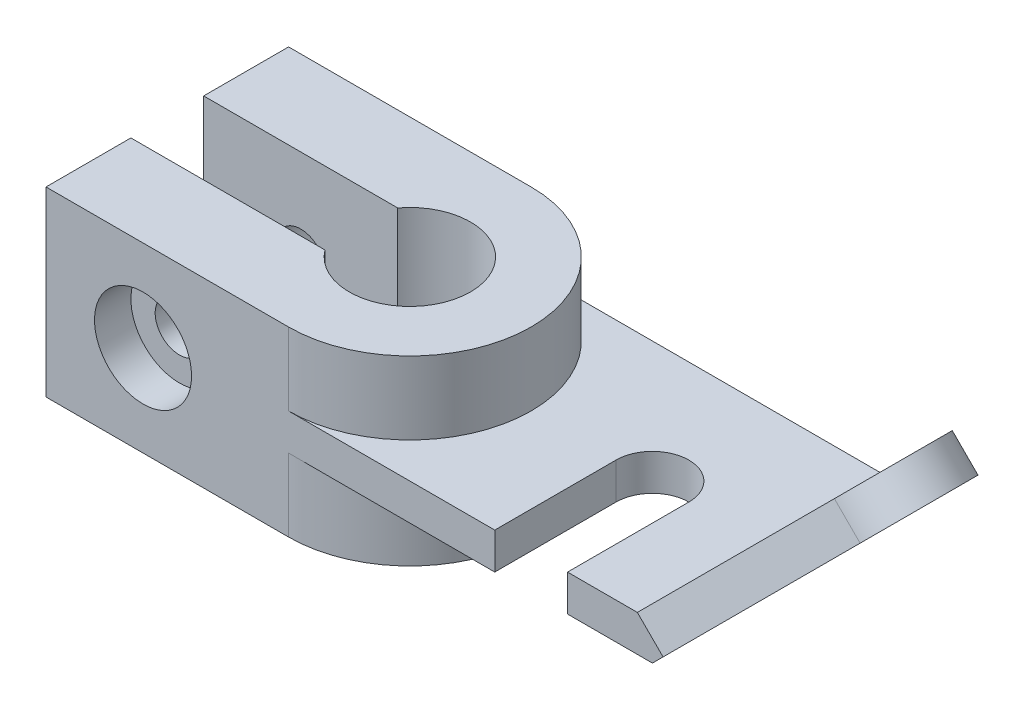
ISO-10303-21;
HEADER;
FILE_DESCRIPTION(('STEP AP214'),'2;1');
FILE_NAME('part.step','',(''),(''),'','','');
FILE_SCHEMA(('AUTOMOTIVE_DESIGN { 1 0 10303 214 1 1 1 1 }'));
ENDSEC;
DATA;
#1=APPLICATION_CONTEXT('core data for automotive mechanical design processes');
#2=APPLICATION_PROTOCOL_DEFINITION('international standard','automotive_design',2000,#1);
#3=PRODUCT_CONTEXT('',#1,'mechanical');
#4=PRODUCT('Part','Part','',(#3));
#5=PRODUCT_RELATED_PRODUCT_CATEGORY('part','',(#4));
#6=PRODUCT_DEFINITION_FORMATION('','',#4);
#7=PRODUCT_DEFINITION_CONTEXT('part definition',#1,'design');
#8=PRODUCT_DEFINITION('design','',#6,#7);
#9=PRODUCT_DEFINITION_SHAPE('','',#8);
#10=(LENGTH_UNIT() NAMED_UNIT(*) SI_UNIT(.MILLI.,.METRE.));
#11=(NAMED_UNIT(*) PLANE_ANGLE_UNIT() SI_UNIT($,.RADIAN.));
#12=(NAMED_UNIT(*) SI_UNIT($,.STERADIAN.) SOLID_ANGLE_UNIT());
#13=UNCERTAINTY_MEASURE_WITH_UNIT(LENGTH_MEASURE(1.E-05),#10,'distance_accuracy_value','');
#14=(GEOMETRIC_REPRESENTATION_CONTEXT(3) GLOBAL_UNCERTAINTY_ASSIGNED_CONTEXT((#13)) GLOBAL_UNIT_ASSIGNED_CONTEXT((#10,
#11,#12)) REPRESENTATION_CONTEXT('',''));
#15=CARTESIAN_POINT('',(0.,0.,0.));
#16=DIRECTION('',(0.,0.,1.));
#17=DIRECTION('',(1.,0.,0.));
#18=AXIS2_PLACEMENT_3D('',#15,#16,#17);
#19=CARTESIAN_POINT('',(-36.,22.5,-30.));
#20=DIRECTION('',(0.,0.,1.));
#21=DIRECTION('',(1.,0.,0.));
#22=AXIS2_PLACEMENT_3D('',#19,#20,#21);
#23=CYLINDRICAL_SURFACE('',#22,6.);
#24=CARTESIAN_POINT('',(-36.,22.5,-9.));
#25=DIRECTION('',(0.,0.,-1.));
#26=DIRECTION('',(-1.,0.,0.));
#27=AXIS2_PLACEMENT_3D('',#24,#25,#26);
#28=CIRCLE('',#27,6.);
#29=CARTESIAN_POINT('',(-42.,22.5,-9.));
#30=VERTEX_POINT('',#29);
#31=EDGE_CURVE('E251',#30,#30,#28,.T.);
#32=ORIENTED_EDGE('',*,*,#31,.F.);
#33=EDGE_LOOP('',(#32));
#34=FACE_BOUND('',#33,.T.);
#35=CARTESIAN_POINT('',(-36.,22.5,-21.));
#36=DIRECTION('',(0.,0.,-1.));
#37=DIRECTION('',(-1.,0.,0.));
#38=AXIS2_PLACEMENT_3D('',#35,#36,#37);
#39=CIRCLE('',#38,6.);
#40=CARTESIAN_POINT('',(-42.,22.5,-21.));
#41=VERTEX_POINT('',#40);
#42=EDGE_CURVE('E234',#41,#41,#39,.F.);
#43=ORIENTED_EDGE('',*,*,#42,.F.);
#44=EDGE_LOOP('',(#43));
#45=FACE_BOUND('',#44,.T.);
#46=ADVANCED_FACE('F45',(#34,#45),#23,.F.);
#47=CARTESIAN_POINT('',(-36.,22.5,8.99999999999999));
#48=DIRECTION('',(0.,0.,1.));
#49=DIRECTION('',(1.,0.,0.));
#50=AXIS2_PLACEMENT_3D('',#47,#48,#49);
#51=CIRCLE('',#50,6.);
#52=CARTESIAN_POINT('',(-30.,22.5,8.99999999999999));
#53=VERTEX_POINT('',#52);
#54=EDGE_CURVE('E247',#53,#53,#51,.T.);
#55=ORIENTED_EDGE('',*,*,#54,.F.);
#56=EDGE_LOOP('',(#55));
#57=FACE_BOUND('',#56,.T.);
#58=CARTESIAN_POINT('',(-36.,22.5,21.));
#59=DIRECTION('',(0.,0.,1.));
#60=DIRECTION('',(1.,0.,0.));
#61=AXIS2_PLACEMENT_3D('',#58,#59,#60);
#62=CIRCLE('',#61,6.);
#63=CARTESIAN_POINT('',(-30.,22.5,21.));
#64=VERTEX_POINT('',#63);
#65=EDGE_CURVE('E242',#64,#64,#62,.F.);
#66=ORIENTED_EDGE('',*,*,#65,.F.);
#67=EDGE_LOOP('',(#66));
#68=FACE_BOUND('',#67,.T.);
#69=ADVANCED_FACE('F489',(#57,#68),#23,.F.);
#70=CARTESIAN_POINT('',(0.,45.,0.));
#71=DIRECTION('',(0.,-1.,0.));
#72=DIRECTION('',(0.,0.,-1.));
#73=AXIS2_PLACEMENT_3D('',#70,#71,#72);
#74=CYLINDRICAL_SURFACE('',#73,30.);
#75=CARTESIAN_POINT('',(0.,18.,0.));
#76=DIRECTION('',(0.,-1.,0.));
#77=DIRECTION('',(0.,0.,-1.));
#78=AXIS2_PLACEMENT_3D('',#75,#76,#77);
#79=CIRCLE('',#78,30.);
#80=CARTESIAN_POINT('',(0.,18.,30.));
#81=VERTEX_POINT('',#80);
#82=CARTESIAN_POINT('',(0.,18.,-30.));
#83=VERTEX_POINT('',#82);
#84=EDGE_CURVE('E401',#81,#83,#79,.F.);
#85=ORIENTED_EDGE('',*,*,#84,.F.);
#86=DIRECTION('',(0.,-1.,0.));
#87=VECTOR('',#86,1.);
#88=CARTESIAN_POINT('',(0.,18.,30.));
#89=LINE('',#88,#87);
#90=CARTESIAN_POINT('',(0.,0.,30.));
#91=VERTEX_POINT('',#90);
#92=EDGE_CURVE('E289',#81,#91,#89,.T.);
#93=ORIENTED_EDGE('',*,*,#92,.T.);
#94=CARTESIAN_POINT('',(0.,0.,0.));
#95=DIRECTION('',(0.,1.,0.));
#96=DIRECTION('',(0.,0.,1.));
#97=AXIS2_PLACEMENT_3D('',#94,#95,#96);
#98=CIRCLE('',#97,30.);
#99=CARTESIAN_POINT('',(0.,0.,-30.));
#100=VERTEX_POINT('',#99);
#101=EDGE_CURVE('E255',#91,#100,#98,.T.);
#102=ORIENTED_EDGE('',*,*,#101,.T.);
#103=DIRECTION('',(0.,-1.,0.));
#104=VECTOR('',#103,1.);
#105=CARTESIAN_POINT('',(0.,18.,-30.));
#106=LINE('',#105,#104);
#107=EDGE_CURVE('E290',#83,#100,#106,.T.);
#108=ORIENTED_EDGE('',*,*,#107,.F.);
#109=EDGE_LOOP('',(#85,#93,#102,#108));
#110=FACE_BOUND('',#109,.T.);
#111=ADVANCED_FACE('F442',(#110),#74,.T.);
#112=CARTESIAN_POINT('',(0.,27.,0.));
#113=DIRECTION('',(0.,1.,0.));
#114=DIRECTION('',(0.,0.,1.));
#115=AXIS2_PLACEMENT_3D('',#112,#113,#114);
#116=PLANE('',#115);
#117=DIRECTION('',(0.,0.,1.));
#118=VECTOR('',#117,1.);
#119=CARTESIAN_POINT('',(86.2720779386422,27.,0.));
#120=LINE('',#119,#118);
#121=CARTESIAN_POINT('',(86.2720779386421,27.,-30.));
#122=VERTEX_POINT('',#121);
#123=CARTESIAN_POINT('',(86.2720779386422,27.,30.));
#124=VERTEX_POINT('',#123);
#125=EDGE_CURVE('E202',#122,#124,#120,.T.);
#126=ORIENTED_EDGE('',*,*,#125,.F.);
#127=DIRECTION('',(-1.,0.,0.));
#128=VECTOR('',#127,1.);
#129=CARTESIAN_POINT('',(90.,27.,-30.));
#130=LINE('',#129,#128);
#131=CARTESIAN_POINT('',(0.,27.,-30.));
#132=VERTEX_POINT('',#131);
#133=EDGE_CURVE('E302',#122,#132,#130,.T.);
#134=ORIENTED_EDGE('',*,*,#133,.T.);
#135=CARTESIAN_POINT('',(0.,27.,0.));
#136=DIRECTION('',(0.,1.,0.));
#137=DIRECTION('',(0.,0.,1.));
#138=AXIS2_PLACEMENT_3D('',#135,#136,#137);
#139=CIRCLE('',#138,30.);
#140=CARTESIAN_POINT('',(0.,27.,30.));
#141=VERTEX_POINT('',#140);
#142=EDGE_CURVE('E260',#132,#141,#139,.F.);
#143=ORIENTED_EDGE('',*,*,#142,.T.);
#144=DIRECTION('',(1.,0.,0.));
#145=VECTOR('',#144,1.);
#146=CARTESIAN_POINT('',(0.,27.,30.));
#147=LINE('',#146,#145);
#148=CARTESIAN_POINT('',(51.,27.,30.));
#149=VERTEX_POINT('',#148);
#150=EDGE_CURVE('E305',#141,#149,#147,.T.);
#151=ORIENTED_EDGE('',*,*,#150,.T.);
#152=DIRECTION('',(0.,0.,-1.));
#153=VECTOR('',#152,1.);
#154=CARTESIAN_POINT('',(51.,27.,30.));
#155=LINE('',#154,#153);
#156=CARTESIAN_POINT('',(51.,27.,0.));
#157=VERTEX_POINT('',#156);
#158=EDGE_CURVE('E309',#149,#157,#155,.T.);
#159=ORIENTED_EDGE('',*,*,#158,.T.);
#160=CARTESIAN_POINT('',(60.,27.,0.));
#161=DIRECTION('',(0.,-1.,0.));
#162=DIRECTION('',(0.,0.,1.));
#163=AXIS2_PLACEMENT_3D('',#160,#161,#162);
#164=CIRCLE('',#163,8.99999999999999);
#165=CARTESIAN_POINT('',(69.,27.,0.));
#166=VERTEX_POINT('',#165);
#167=EDGE_CURVE('E313',#157,#166,#164,.T.);
#168=ORIENTED_EDGE('',*,*,#167,.T.);
#169=DIRECTION('',(0.,0.,1.));
#170=VECTOR('',#169,1.);
#171=CARTESIAN_POINT('',(69.,27.,0.));
#172=LINE('',#171,#170);
#173=CARTESIAN_POINT('',(69.,27.,30.));
#174=VERTEX_POINT('',#173);
#175=EDGE_CURVE('E293',#166,#174,#172,.T.);
#176=ORIENTED_EDGE('',*,*,#175,.T.);
#177=DIRECTION('',(1.,0.,0.));
#178=VECTOR('',#177,1.);
#179=CARTESIAN_POINT('',(69.,27.,30.));
#180=LINE('',#179,#178);
#181=EDGE_CURVE('E299',#174,#124,#180,.T.);
#182=ORIENTED_EDGE('',*,*,#181,.T.);
#183=EDGE_LOOP('',(#126,#134,#143,#151,#159,#168,#176,#182));
#184=FACE_BOUND('',#183,.T.);
#185=ADVANCED_FACE('F427',(#184),#116,.T.);
#186=CARTESIAN_POINT('',(60.,18.,0.));
#187=DIRECTION('',(0.,-1.,0.));
#188=DIRECTION('',(0.,0.,-1.));
#189=AXIS2_PLACEMENT_3D('',#186,#187,#188);
#190=PLANE('',#189);
#191=DIRECTION('',(-1.,0.,0.));
#192=VECTOR('',#191,1.);
#193=CARTESIAN_POINT('',(0.,18.,30.));
#194=LINE('',#193,#192);
#195=CARTESIAN_POINT('',(51.,18.,30.));
#196=VERTEX_POINT('',#195);
#197=EDGE_CURVE('E266',#196,#81,#194,.T.);
#198=ORIENTED_EDGE('',*,*,#197,.T.);
#199=ORIENTED_EDGE('',*,*,#84,.T.);
#200=DIRECTION('',(1.,0.,0.));
#201=VECTOR('',#200,1.);
#202=CARTESIAN_POINT('',(0.,18.,-30.));
#203=LINE('',#202,#201);
#204=CARTESIAN_POINT('',(90.,18.,-30.));
#205=VERTEX_POINT('',#204);
#206=EDGE_CURVE('E269',#83,#205,#203,.T.);
#207=ORIENTED_EDGE('',*,*,#206,.T.);
#208=DIRECTION('',(0.,0.,1.));
#209=VECTOR('',#208,1.);
#210=CARTESIAN_POINT('',(90.,18.,30.));
#211=LINE('',#210,#209);
#212=CARTESIAN_POINT('',(90.,18.,30.));
#213=VERTEX_POINT('',#212);
#214=EDGE_CURVE('E273',#205,#213,#211,.T.);
#215=ORIENTED_EDGE('',*,*,#214,.T.);
#216=DIRECTION('',(-1.,0.,0.));
#217=VECTOR('',#216,1.);
#218=CARTESIAN_POINT('',(69.,18.,30.));
#219=LINE('',#218,#217);
#220=CARTESIAN_POINT('',(69.,18.,30.));
#221=VERTEX_POINT('',#220);
#222=EDGE_CURVE('E277',#213,#221,#219,.T.);
#223=ORIENTED_EDGE('',*,*,#222,.T.);
#224=DIRECTION('',(0.,0.,-1.));
#225=VECTOR('',#224,1.);
#226=CARTESIAN_POINT('',(69.,18.,0.));
#227=LINE('',#226,#225);
#228=CARTESIAN_POINT('',(69.,18.,0.));
#229=VERTEX_POINT('',#228);
#230=EDGE_CURVE('E280',#221,#229,#227,.T.);
#231=ORIENTED_EDGE('',*,*,#230,.T.);
#232=CARTESIAN_POINT('',(60.,18.,0.));
#233=DIRECTION('',(0.,1.,0.));
#234=DIRECTION('',(0.,0.,-1.));
#235=AXIS2_PLACEMENT_3D('',#232,#233,#234);
#236=CIRCLE('',#235,8.99999999999999);
#237=CARTESIAN_POINT('',(51.,18.,0.));
#238=VERTEX_POINT('',#237);
#239=EDGE_CURVE('E283',#229,#238,#236,.T.);
#240=ORIENTED_EDGE('',*,*,#239,.T.);
#241=DIRECTION('',(0.,0.,1.));
#242=VECTOR('',#241,1.);
#243=CARTESIAN_POINT('',(51.,18.,30.));
#244=LINE('',#243,#242);
#245=EDGE_CURVE('E286',#238,#196,#244,.T.);
#246=ORIENTED_EDGE('',*,*,#245,.T.);
#247=EDGE_LOOP('',(#198,#199,#207,#215,#223,#231,#240,#246));
#248=FACE_BOUND('',#247,.T.);
#249=ADVANCED_FACE('F436',(#248),#190,.T.);
#250=CARTESIAN_POINT('',(90.,0.,30.));
#251=DIRECTION('',(0.,0.,1.));
#252=DIRECTION('',(1.,0.,0.));
#253=AXIS2_PLACEMENT_3D('',#250,#251,#252);
#254=PLANE('',#253);
#255=DIRECTION('',(-0.707106781186544,0.707106781186551,0.));
#256=VECTOR('',#255,1.);
#257=CARTESIAN_POINT('',(123.026019100214,-9.75394116157223,30.));
#258=LINE('',#257,#256);
#259=CARTESIAN_POINT('',(92.6360389693211,20.636038969321,30.));
#260=VERTEX_POINT('',#259);
#261=EDGE_CURVE('E197',#260,#124,#258,.T.);
#262=ORIENTED_EDGE('',*,*,#261,.T.);
#263=ORIENTED_EDGE('',*,*,#181,.F.);
#264=DIRECTION('',(0.,1.,0.));
#265=VECTOR('',#264,1.);
#266=CARTESIAN_POINT('',(69.,0.,30.));
#267=LINE('',#266,#265);
#268=EDGE_CURVE('E325',#221,#174,#267,.T.);
#269=ORIENTED_EDGE('',*,*,#268,.F.);
#270=ORIENTED_EDGE('',*,*,#222,.F.);
#271=DIRECTION('',(0.707106781186551,0.707106781186544,0.));
#272=VECTOR('',#271,1.);
#273=CARTESIAN_POINT('',(90.,18.,30.));
#274=LINE('',#273,#272);
#275=EDGE_CURVE('E217',#213,#260,#274,.T.);
#276=ORIENTED_EDGE('',*,*,#275,.T.);
#277=EDGE_LOOP('',(#262,#263,#269,#270,#276));
#278=FACE_BOUND('',#277,.T.);
#279=ADVANCED_FACE('F433',(#278),#254,.T.);
#280=CARTESIAN_POINT('',(69.,0.,0.));
#281=DIRECTION('',(-1.,0.,0.));
#282=DIRECTION('',(0.,0.,1.));
#283=AXIS2_PLACEMENT_3D('',#280,#281,#282);
#284=PLANE('',#283);
#285=DIRECTION('',(0.,1.,0.));
#286=VECTOR('',#285,1.);
#287=CARTESIAN_POINT('',(69.,0.,0.));
#288=LINE('',#287,#286);
#289=EDGE_CURVE('E329',#229,#166,#288,.T.);
#290=ORIENTED_EDGE('',*,*,#289,.F.);
#291=ORIENTED_EDGE('',*,*,#230,.F.);
#292=ORIENTED_EDGE('',*,*,#268,.T.);
#293=ORIENTED_EDGE('',*,*,#175,.F.);
#294=EDGE_LOOP('',(#290,#291,#292,#293));
#295=FACE_BOUND('',#294,.T.);
#296=ADVANCED_FACE('F478',(#295),#284,.T.);
#297=CARTESIAN_POINT('',(60.,0.,0.));
#298=DIRECTION('',(0.,1.,0.));
#299=DIRECTION('',(0.,0.,1.));
#300=AXIS2_PLACEMENT_3D('',#297,#298,#299);
#301=CYLINDRICAL_SURFACE('',#300,8.99999999999999);
#302=DIRECTION('',(0.,1.,0.));
#303=VECTOR('',#302,1.);
#304=CARTESIAN_POINT('',(51.,0.,0.));
#305=LINE('',#304,#303);
#306=EDGE_CURVE('E332',#238,#157,#305,.T.);
#307=ORIENTED_EDGE('',*,*,#306,.F.);
#308=ORIENTED_EDGE('',*,*,#239,.F.);
#309=ORIENTED_EDGE('',*,*,#289,.T.);
#310=ORIENTED_EDGE('',*,*,#167,.F.);
#311=EDGE_LOOP('',(#307,#308,#309,#310));
#312=FACE_BOUND('',#311,.T.);
#313=ADVANCED_FACE('F475',(#312),#301,.F.);
#314=CARTESIAN_POINT('',(51.,0.,0.));
#315=DIRECTION('',(1.,0.,0.));
#316=DIRECTION('',(0.,0.,-1.));
#317=AXIS2_PLACEMENT_3D('',#314,#315,#316);
#318=PLANE('',#317);
#319=DIRECTION('',(0.,1.,0.));
#320=VECTOR('',#319,1.);
#321=CARTESIAN_POINT('',(51.,0.,30.));
#322=LINE('',#321,#320);
#323=EDGE_CURVE('E321',#196,#149,#322,.T.);
#324=ORIENTED_EDGE('',*,*,#323,.F.);
#325=ORIENTED_EDGE('',*,*,#245,.F.);
#326=ORIENTED_EDGE('',*,*,#306,.T.);
#327=ORIENTED_EDGE('',*,*,#158,.F.);
#328=EDGE_LOOP('',(#324,#325,#326,#327));
#329=FACE_BOUND('',#328,.T.);
#330=ADVANCED_FACE('F470',(#329),#318,.T.);
#331=CARTESIAN_POINT('',(-60.,45.,-30.));
#332=DIRECTION('',(0.,0.,1.));
#333=DIRECTION('',(1.,0.,0.));
#334=AXIS2_PLACEMENT_3D('',#331,#332,#333);
#335=PLANE('',#334);
#336=ORIENTED_EDGE('',*,*,#133,.F.);
#337=DIRECTION('',(-0.707106781186544,0.707106781186551,0.));
#338=VECTOR('',#337,1.);
#339=CARTESIAN_POINT('',(123.026019100214,-9.75394116157225,-30.));
#340=LINE('',#339,#338);
#341=CARTESIAN_POINT('',(92.636038969321,20.636038969321,-30.));
#342=VERTEX_POINT('',#341);
#343=EDGE_CURVE('E188',#342,#122,#340,.T.);
#344=ORIENTED_EDGE('',*,*,#343,.F.);
#345=DIRECTION('',(0.707106781186551,0.707106781186544,0.));
#346=VECTOR('',#345,1.);
#347=CARTESIAN_POINT('',(90.,18.,-30.));
#348=LINE('',#347,#346);
#349=EDGE_CURVE('E220',#205,#342,#348,.T.);
#350=ORIENTED_EDGE('',*,*,#349,.F.);
#351=ORIENTED_EDGE('',*,*,#206,.F.);
#352=ORIENTED_EDGE('',*,*,#107,.T.);
#353=DIRECTION('',(-1.,0.,0.));
#354=VECTOR('',#353,1.);
#355=CARTESIAN_POINT('',(-60.,0.,-30.));
#356=LINE('',#355,#354);
#357=CARTESIAN_POINT('',(-60.,0.,-30.));
#358=VERTEX_POINT('',#357);
#359=EDGE_CURVE('E328',#100,#358,#356,.T.);
#360=ORIENTED_EDGE('',*,*,#359,.T.);
#361=DIRECTION('',(0.,-1.,0.));
#362=VECTOR('',#361,1.);
#363=CARTESIAN_POINT('',(-60.,45.,-30.));
#364=LINE('',#363,#362);
#365=CARTESIAN_POINT('',(-60.,45.,-30.));
#366=VERTEX_POINT('',#365);
#367=EDGE_CURVE('E397',#366,#358,#364,.T.);
#368=ORIENTED_EDGE('',*,*,#367,.F.);
#369=DIRECTION('',(-1.,0.,0.));
#370=VECTOR('',#369,1.);
#371=CARTESIAN_POINT('',(-60.,45.,-30.));
#372=LINE('',#371,#370);
#373=CARTESIAN_POINT('',(0.,45.,-30.));
#374=VERTEX_POINT('',#373);
#375=EDGE_CURVE('E337',#374,#366,#372,.T.);
#376=ORIENTED_EDGE('',*,*,#375,.F.);
#377=DIRECTION('',(0.,1.,0.));
#378=VECTOR('',#377,1.);
#379=CARTESIAN_POINT('',(0.,27.,-30.));
#380=LINE('',#379,#378);
#381=EDGE_CURVE('E317',#132,#374,#380,.T.);
#382=ORIENTED_EDGE('',*,*,#381,.F.);
#383=EDGE_LOOP('',(#336,#344,#350,#351,#352,#360,#368,#376,#382));
#384=FACE_BOUND('',#383,.T.);
#385=CARTESIAN_POINT('',(-36.,22.5,-30.));
#386=DIRECTION('',(0.,0.,-1.));
#387=DIRECTION('',(-1.,0.,0.));
#388=AXIS2_PLACEMENT_3D('',#385,#386,#387);
#389=CIRCLE('',#388,12.);
#390=CARTESIAN_POINT('',(-48.,22.5,-30.));
#391=VERTEX_POINT('',#390);
#392=EDGE_CURVE('E229',#391,#391,#389,.T.);
#393=ORIENTED_EDGE('',*,*,#392,.F.);
#394=EDGE_LOOP('',(#393));
#395=FACE_BOUND('',#394,.T.);
#396=ADVANCED_FACE('F47',(#384,#395),#335,.F.);
#397=CARTESIAN_POINT('',(-60.,45.,-30.));
#398=DIRECTION('',(1.,0.,0.));
#399=DIRECTION('',(0.,0.,-1.));
#400=AXIS2_PLACEMENT_3D('',#397,#398,#399);
#401=PLANE('',#400);
#402=DIRECTION('',(0.,0.,1.));
#403=VECTOR('',#402,1.);
#404=CARTESIAN_POINT('',(-60.,0.,-30.));
#405=LINE('',#404,#403);
#406=CARTESIAN_POINT('',(-60.,0.,-8.99999999999999));
#407=VERTEX_POINT('',#406);
#408=EDGE_CURVE('E362',#358,#407,#405,.T.);
#409=ORIENTED_EDGE('',*,*,#408,.T.);
#410=DIRECTION('',(0.,-1.,0.));
#411=VECTOR('',#410,1.);
#412=CARTESIAN_POINT('',(-60.,45.,-8.99999999999999));
#413=LINE('',#412,#411);
#414=CARTESIAN_POINT('',(-60.,45.,-8.99999999999999));
#415=VERTEX_POINT('',#414);
#416=EDGE_CURVE('E393',#415,#407,#413,.T.);
#417=ORIENTED_EDGE('',*,*,#416,.F.);
#418=DIRECTION('',(0.,0.,1.));
#419=VECTOR('',#418,1.);
#420=CARTESIAN_POINT('',(-60.,45.,-30.));
#421=LINE('',#420,#419);
#422=EDGE_CURVE('E340',#366,#415,#421,.T.);
#423=ORIENTED_EDGE('',*,*,#422,.F.);
#424=ORIENTED_EDGE('',*,*,#367,.T.);
#425=EDGE_LOOP('',(#409,#417,#423,#424));
#426=FACE_BOUND('',#425,.T.);
#427=ADVANCED_FACE('F453',(#426),#401,.F.);
#428=CARTESIAN_POINT('',(-12.,45.,-9.));
#429=DIRECTION('',(0.,0.,-1.));
#430=DIRECTION('',(-1.,0.,0.));
#431=AXIS2_PLACEMENT_3D('',#428,#429,#430);
#432=PLANE('',#431);
#433=ORIENTED_EDGE('',*,*,#31,.T.);
#434=EDGE_LOOP('',(#433));
#435=FACE_BOUND('',#434,.T.);
#436=DIRECTION('',(1.,0.,0.));
#437=VECTOR('',#436,1.);
#438=CARTESIAN_POINT('',(-12.,0.,-9.));
#439=LINE('',#438,#437);
#440=CARTESIAN_POINT('',(-12.,0.,-9.));
#441=VERTEX_POINT('',#440);
#442=EDGE_CURVE('E365',#407,#441,#439,.T.);
#443=ORIENTED_EDGE('',*,*,#442,.T.);
#444=DIRECTION('',(0.,-1.,0.));
#445=VECTOR('',#444,1.);
#446=CARTESIAN_POINT('',(-12.,45.,-9.));
#447=LINE('',#446,#445);
#448=CARTESIAN_POINT('',(-12.,45.,-9.));
#449=VERTEX_POINT('',#448);
#450=EDGE_CURVE('E389',#449,#441,#447,.T.);
#451=ORIENTED_EDGE('',*,*,#450,.F.);
#452=DIRECTION('',(1.,0.,0.));
#453=VECTOR('',#452,1.);
#454=CARTESIAN_POINT('',(-12.,45.,-9.));
#455=LINE('',#454,#453);
#456=EDGE_CURVE('E343',#415,#449,#455,.T.);
#457=ORIENTED_EDGE('',*,*,#456,.F.);
#458=ORIENTED_EDGE('',*,*,#416,.T.);
#459=EDGE_LOOP('',(#443,#451,#457,#458));
#460=FACE_BOUND('',#459,.T.);
#461=ADVANCED_FACE('F649',(#435,#460),#432,.F.);
#462=CARTESIAN_POINT('',(0.,45.,0.));
#463=DIRECTION('',(0.,-1.,0.));
#464=DIRECTION('',(0.,0.,-1.));
#465=AXIS2_PLACEMENT_3D('',#462,#463,#464);
#466=CYLINDRICAL_SURFACE('',#465,15.);
#467=DIRECTION('',(0.,-1.,0.));
#468=VECTOR('',#467,1.);
#469=CARTESIAN_POINT('',(-12.,45.,8.99999999999999));
#470=LINE('',#469,#468);
#471=CARTESIAN_POINT('',(-12.,45.,8.99999999999999));
#472=VERTEX_POINT('',#471);
#473=CARTESIAN_POINT('',(-12.,0.,8.99999999999999));
#474=VERTEX_POINT('',#473);
#475=EDGE_CURVE('E385',#472,#474,#470,.T.);
#476=ORIENTED_EDGE('',*,*,#475,.F.);
#477=CARTESIAN_POINT('',(0.,45.,0.));
#478=DIRECTION('',(0.,-1.,0.));
#479=DIRECTION('',(0.,0.,1.));
#480=AXIS2_PLACEMENT_3D('',#477,#478,#479);
#481=CIRCLE('',#480,15.);
#482=EDGE_CURVE('E346',#449,#472,#481,.T.);
#483=ORIENTED_EDGE('',*,*,#482,.F.);
#484=ORIENTED_EDGE('',*,*,#450,.T.);
#485=CARTESIAN_POINT('',(0.,0.,0.));
#486=DIRECTION('',(0.,-1.,0.));
#487=DIRECTION('',(0.,0.,1.));
#488=AXIS2_PLACEMENT_3D('',#485,#486,#487);
#489=CIRCLE('',#488,15.);
#490=EDGE_CURVE('E368',#441,#474,#489,.T.);
#491=ORIENTED_EDGE('',*,*,#490,.T.);
#492=EDGE_LOOP('',(#476,#483,#484,#491));
#493=FACE_BOUND('',#492,.T.);
#494=ADVANCED_FACE('F655',(#493),#466,.F.);
#495=CARTESIAN_POINT('',(-12.,45.,8.99999999999999));
#496=DIRECTION('',(0.,0.,1.));
#497=DIRECTION('',(1.,0.,0.));
#498=AXIS2_PLACEMENT_3D('',#495,#496,#497);
#499=PLANE('',#498);
#500=ORIENTED_EDGE('',*,*,#54,.T.);
#501=EDGE_LOOP('',(#500));
#502=FACE_BOUND('',#501,.T.);
#503=DIRECTION('',(-1.,0.,0.));
#504=VECTOR('',#503,1.);
#505=CARTESIAN_POINT('',(-12.,0.,8.99999999999999));
#506=LINE('',#505,#504);
#507=CARTESIAN_POINT('',(-60.,0.,9.));
#508=VERTEX_POINT('',#507);
#509=EDGE_CURVE('E371',#474,#508,#506,.T.);
#510=ORIENTED_EDGE('',*,*,#509,.T.);
#511=DIRECTION('',(0.,-1.,0.));
#512=VECTOR('',#511,1.);
#513=CARTESIAN_POINT('',(-60.,45.,9.));
#514=LINE('',#513,#512);
#515=CARTESIAN_POINT('',(-60.,45.,9.));
#516=VERTEX_POINT('',#515);
#517=EDGE_CURVE('E381',#516,#508,#514,.T.);
#518=ORIENTED_EDGE('',*,*,#517,.F.);
#519=DIRECTION('',(-1.,0.,0.));
#520=VECTOR('',#519,1.);
#521=CARTESIAN_POINT('',(-12.,45.,8.99999999999999));
#522=LINE('',#521,#520);
#523=EDGE_CURVE('E349',#472,#516,#522,.T.);
#524=ORIENTED_EDGE('',*,*,#523,.F.);
#525=ORIENTED_EDGE('',*,*,#475,.T.);
#526=EDGE_LOOP('',(#510,#518,#524,#525));
#527=FACE_BOUND('',#526,.T.);
#528=ADVANCED_FACE('F667',(#502,#527),#499,.F.);
#529=CARTESIAN_POINT('',(-60.,45.,9.));
#530=DIRECTION('',(1.,0.,0.));
#531=DIRECTION('',(0.,0.,-1.));
#532=AXIS2_PLACEMENT_3D('',#529,#530,#531);
#533=PLANE('',#532);
#534=DIRECTION('',(0.,0.,1.));
#535=VECTOR('',#534,1.);
#536=CARTESIAN_POINT('',(-60.,0.,9.));
#537=LINE('',#536,#535);
#538=CARTESIAN_POINT('',(-60.,0.,30.));
#539=VERTEX_POINT('',#538);
#540=EDGE_CURVE('E374',#508,#539,#537,.T.);
#541=ORIENTED_EDGE('',*,*,#540,.T.);
#542=DIRECTION('',(0.,-1.,0.));
#543=VECTOR('',#542,1.);
#544=CARTESIAN_POINT('',(-60.,45.,30.));
#545=LINE('',#544,#543);
#546=CARTESIAN_POINT('',(-60.,45.,30.));
#547=VERTEX_POINT('',#546);
#548=EDGE_CURVE('E359',#547,#539,#545,.T.);
#549=ORIENTED_EDGE('',*,*,#548,.F.);
#550=DIRECTION('',(0.,0.,1.));
#551=VECTOR('',#550,1.);
#552=CARTESIAN_POINT('',(-60.,45.,9.));
#553=LINE('',#552,#551);
#554=EDGE_CURVE('E352',#516,#547,#553,.T.);
#555=ORIENTED_EDGE('',*,*,#554,.F.);
#556=ORIENTED_EDGE('',*,*,#517,.T.);
#557=EDGE_LOOP('',(#541,#549,#555,#556));
#558=FACE_BOUND('',#557,.T.);
#559=ADVANCED_FACE('F679',(#558),#533,.F.);
#560=CARTESIAN_POINT('',(-60.,45.,30.));
#561=DIRECTION('',(0.,0.,-1.));
#562=DIRECTION('',(-1.,0.,0.));
#563=AXIS2_PLACEMENT_3D('',#560,#561,#562);
#564=PLANE('',#563);
#565=CARTESIAN_POINT('',(-36.,22.5,30.));
#566=DIRECTION('',(0.,0.,1.));
#567=DIRECTION('',(1.,0.,0.));
#568=AXIS2_PLACEMENT_3D('',#565,#566,#567);
#569=CIRCLE('',#568,12.);
#570=CARTESIAN_POINT('',(-24.,22.5,30.));
#571=VERTEX_POINT('',#570);
#572=EDGE_CURVE('E243',#571,#571,#569,.T.);
#573=ORIENTED_EDGE('',*,*,#572,.F.);
#574=EDGE_LOOP('',(#573));
#575=FACE_BOUND('',#574,.T.);
#576=ORIENTED_EDGE('',*,*,#92,.F.);
#577=ORIENTED_EDGE('',*,*,#197,.F.);
#578=ORIENTED_EDGE('',*,*,#323,.T.);
#579=ORIENTED_EDGE('',*,*,#150,.F.);
#580=DIRECTION('',(0.,1.,0.));
#581=VECTOR('',#580,1.);
#582=CARTESIAN_POINT('',(0.,27.,30.));
#583=LINE('',#582,#581);
#584=CARTESIAN_POINT('',(0.,45.,30.));
#585=VERTEX_POINT('',#584);
#586=EDGE_CURVE('E318',#141,#585,#583,.T.);
#587=ORIENTED_EDGE('',*,*,#586,.T.);
#588=DIRECTION('',(1.,0.,0.));
#589=VECTOR('',#588,1.);
#590=CARTESIAN_POINT('',(-60.,45.,30.));
#591=LINE('',#590,#589);
#592=EDGE_CURVE('E355',#547,#585,#591,.T.);
#593=ORIENTED_EDGE('',*,*,#592,.F.);
#594=ORIENTED_EDGE('',*,*,#548,.T.);
#595=DIRECTION('',(1.,0.,0.));
#596=VECTOR('',#595,1.);
#597=CARTESIAN_POINT('',(-60.,0.,30.));
#598=LINE('',#597,#596);
#599=EDGE_CURVE('E70',#539,#91,#598,.T.);
#600=ORIENTED_EDGE('',*,*,#599,.T.);
#601=EDGE_LOOP('',(#576,#577,#578,#579,#587,#593,#594,#600));
#602=FACE_BOUND('',#601,.T.);
#603=ADVANCED_FACE('F464',(#575,#602),#564,.F.);
#604=CARTESIAN_POINT('',(0.,45.,0.));
#605=DIRECTION('',(0.,1.,0.));
#606=DIRECTION('',(0.,0.,1.));
#607=AXIS2_PLACEMENT_3D('',#604,#605,#606);
#608=PLANE('',#607);
#609=ORIENTED_EDGE('',*,*,#482,.T.);
#610=ORIENTED_EDGE('',*,*,#523,.T.);
#611=ORIENTED_EDGE('',*,*,#554,.T.);
#612=ORIENTED_EDGE('',*,*,#592,.T.);
#613=CARTESIAN_POINT('',(0.,45.,0.));
#614=DIRECTION('',(0.,1.,0.));
#615=DIRECTION('',(0.,0.,1.));
#616=AXIS2_PLACEMENT_3D('',#613,#614,#615);
#617=CIRCLE('',#616,30.);
#618=EDGE_CURVE('E256',#585,#374,#617,.T.);
#619=ORIENTED_EDGE('',*,*,#618,.T.);
#620=ORIENTED_EDGE('',*,*,#375,.T.);
#621=ORIENTED_EDGE('',*,*,#422,.T.);
#622=ORIENTED_EDGE('',*,*,#456,.T.);
#623=EDGE_LOOP('',(#609,#610,#611,#612,#619,#620,#621,#622));
#624=FACE_BOUND('',#623,.T.);
#625=ADVANCED_FACE('F457',(#624),#608,.T.);
#626=CARTESIAN_POINT('',(0.,0.,0.));
#627=DIRECTION('',(0.,1.,0.));
#628=DIRECTION('',(0.,0.,1.));
#629=AXIS2_PLACEMENT_3D('',#626,#627,#628);
#630=PLANE('',#629);
#631=ORIENTED_EDGE('',*,*,#509,.F.);
#632=ORIENTED_EDGE('',*,*,#490,.F.);
#633=ORIENTED_EDGE('',*,*,#442,.F.);
#634=ORIENTED_EDGE('',*,*,#408,.F.);
#635=ORIENTED_EDGE('',*,*,#359,.F.);
#636=ORIENTED_EDGE('',*,*,#101,.F.);
#637=ORIENTED_EDGE('',*,*,#599,.F.);
#638=ORIENTED_EDGE('',*,*,#540,.F.);
#639=EDGE_LOOP('',(#631,#632,#633,#634,#635,#636,#637,#638));
#640=FACE_BOUND('',#639,.T.);
#641=ADVANCED_FACE('F446',(#640),#630,.F.);
#642=ORIENTED_EDGE('',*,*,#142,.F.);
#643=ORIENTED_EDGE('',*,*,#381,.T.);
#644=ORIENTED_EDGE('',*,*,#618,.F.);
#645=ORIENTED_EDGE('',*,*,#586,.F.);
#646=EDGE_LOOP('',(#642,#643,#644,#645));
#647=FACE_BOUND('',#646,.T.);
#648=ADVANCED_FACE('F463',(#647),#74,.T.);
#649=CARTESIAN_POINT('',(-36.,22.5,21.));
#650=DIRECTION('',(0.,0.,1.));
#651=DIRECTION('',(1.,0.,0.));
#652=AXIS2_PLACEMENT_3D('',#649,#650,#651);
#653=PLANE('',#652);
#654=CARTESIAN_POINT('',(-36.,22.5,21.));
#655=DIRECTION('',(0.,0.,1.));
#656=DIRECTION('',(1.,0.,0.));
#657=AXIS2_PLACEMENT_3D('',#654,#655,#656);
#658=CIRCLE('',#657,12.);
#659=CARTESIAN_POINT('',(-24.,22.5,21.));
#660=VERTEX_POINT('',#659);
#661=EDGE_CURVE('E238',#660,#660,#658,.T.);
#662=ORIENTED_EDGE('',*,*,#661,.T.);
#663=EDGE_LOOP('',(#662));
#664=FACE_BOUND('',#663,.T.);
#665=ORIENTED_EDGE('',*,*,#65,.T.);
#666=EDGE_LOOP('',(#665));
#667=FACE_BOUND('',#666,.T.);
#668=ADVANCED_FACE('F602',(#664,#667),#653,.T.);
#669=CARTESIAN_POINT('',(-36.,22.5,21.));
#670=DIRECTION('',(0.,0.,1.));
#671=DIRECTION('',(1.,0.,0.));
#672=AXIS2_PLACEMENT_3D('',#669,#670,#671);
#673=CYLINDRICAL_SURFACE('',#672,12.);
#674=ORIENTED_EDGE('',*,*,#661,.F.);
#675=EDGE_LOOP('',(#674));
#676=FACE_BOUND('',#675,.T.);
#677=ORIENTED_EDGE('',*,*,#572,.T.);
#678=EDGE_LOOP('',(#677));
#679=FACE_BOUND('',#678,.T.);
#680=ADVANCED_FACE('F502',(#676,#679),#673,.F.);
#681=CARTESIAN_POINT('',(-36.,22.5,-21.));
#682=DIRECTION('',(0.,0.,-1.));
#683=DIRECTION('',(-1.,0.,0.));
#684=AXIS2_PLACEMENT_3D('',#681,#682,#683);
#685=PLANE('',#684);
#686=CARTESIAN_POINT('',(-36.,22.5,-21.));
#687=DIRECTION('',(0.,0.,-1.));
#688=DIRECTION('',(-1.,0.,0.));
#689=AXIS2_PLACEMENT_3D('',#686,#687,#688);
#690=CIRCLE('',#689,12.);
#691=CARTESIAN_POINT('',(-48.,22.5,-21.));
#692=VERTEX_POINT('',#691);
#693=EDGE_CURVE('E230',#692,#692,#690,.T.);
#694=ORIENTED_EDGE('',*,*,#693,.T.);
#695=EDGE_LOOP('',(#694));
#696=FACE_BOUND('',#695,.T.);
#697=ORIENTED_EDGE('',*,*,#42,.T.);
#698=EDGE_LOOP('',(#697));
#699=FACE_BOUND('',#698,.T.);
#700=ADVANCED_FACE('F583',(#696,#699),#685,.T.);
#701=CARTESIAN_POINT('',(-36.,22.5,-21.));
#702=DIRECTION('',(0.,0.,-1.));
#703=DIRECTION('',(-1.,0.,0.));
#704=AXIS2_PLACEMENT_3D('',#701,#702,#703);
#705=CYLINDRICAL_SURFACE('',#704,12.);
#706=ORIENTED_EDGE('',*,*,#693,.F.);
#707=EDGE_LOOP('',(#706));
#708=FACE_BOUND('',#707,.T.);
#709=ORIENTED_EDGE('',*,*,#392,.T.);
#710=EDGE_LOOP('',(#709));
#711=FACE_BOUND('',#710,.T.);
#712=ADVANCED_FACE('F546',(#708,#711),#705,.F.);
#713=CARTESIAN_POINT('',(83.6360389693211,24.363961030679,-30.));
#714=DIRECTION('',(-0.707106781186544,0.707106781186551,0.));
#715=DIRECTION('',(-0.707106781186551,-0.707106781186544,0.));
#716=AXIS2_PLACEMENT_3D('',#713,#714,#715);
#717=PLANE('',#716);
#718=CARTESIAN_POINT('',(115.809397513309,56.5373195746667,0.));
#719=DIRECTION('',(-0.707106781186544,0.707106781186551,0.));
#720=DIRECTION('',(-0.707106781186551,-0.707106781186544,0.));
#721=AXIS2_PLACEMENT_3D('',#718,#719,#720);
#722=CIRCLE('',#721,7.5);
#723=CARTESIAN_POINT('',(110.50609665441,51.2340187157676,0.));
#724=VERTEX_POINT('',#723);
#725=EDGE_CURVE('E208',#724,#724,#722,.T.);
#726=ORIENTED_EDGE('',*,*,#725,.F.);
#727=EDGE_LOOP('',(#726));
#728=FACE_BOUND('',#727,.T.);
#729=DIRECTION('',(-0.669669790048397,-0.66966979004839,0.321068130765233));
#730=VECTOR('',#729,1.);
#731=CARTESIAN_POINT('',(86.2720779386422,27.,30.));
#732=LINE('',#731,#730);
#733=CARTESIAN_POINT('',(119.214839300614,59.9427613619714,14.2058414909697));
#734=VERTEX_POINT('',#733);
#735=EDGE_CURVE('E193',#734,#124,#732,.T.);
#736=ORIENTED_EDGE('',*,*,#735,.F.);
#737=CARTESIAN_POINT('',(115.809397513309,56.5373195746667,0.));
#738=DIRECTION('',(0.707106781186544,-0.707106781186551,0.));
#739=DIRECTION('',(-0.707106781186551,-0.707106781186544,0.));
#740=AXIS2_PLACEMENT_3D('',#737,#738,#739);
#741=CIRCLE('',#740,15.);
#742=CARTESIAN_POINT('',(119.214839300614,59.9427613619714,-14.2058414909697));
#743=VERTEX_POINT('',#742);
#744=EDGE_CURVE('E180',#743,#734,#741,.T.);
#745=ORIENTED_EDGE('',*,*,#744,.F.);
#746=DIRECTION('',(0.669669790048397,0.66966979004839,0.321068130765233));
#747=VECTOR('',#746,1.);
#748=CARTESIAN_POINT('',(119.214839300614,59.9427613619714,-14.2058414909697));
#749=LINE('',#748,#747);
#750=EDGE_CURVE('E189',#122,#743,#749,.T.);
#751=ORIENTED_EDGE('',*,*,#750,.F.);
#752=ORIENTED_EDGE('',*,*,#125,.T.);
#753=EDGE_LOOP('',(#736,#745,#751,#752));
#754=FACE_BOUND('',#753,.T.);
#755=ADVANCED_FACE('F200',(#728,#754),#717,.T.);
#756=CARTESIAN_POINT('',(90.,18.,-30.));
#757=DIRECTION('',(0.707106781186544,-0.707106781186551,0.));
#758=DIRECTION('',(0.707106781186551,0.707106781186544,0.));
#759=AXIS2_PLACEMENT_3D('',#756,#757,#758);
#760=PLANE('',#759);
#761=CARTESIAN_POINT('',(122.173358543988,50.1733585439877,0.));
#762=DIRECTION('',(0.707106781186544,-0.707106781186551,0.));
#763=DIRECTION('',(0.707106781186551,0.707106781186544,0.));
#764=AXIS2_PLACEMENT_3D('',#761,#762,#763);
#765=CIRCLE('',#764,7.5);
#766=CARTESIAN_POINT('',(127.476659402887,55.4766594028868,0.));
#767=VERTEX_POINT('',#766);
#768=EDGE_CURVE('E49',#767,#767,#765,.T.);
#769=ORIENTED_EDGE('',*,*,#768,.F.);
#770=EDGE_LOOP('',(#769));
#771=FACE_BOUND('',#770,.T.);
#772=CARTESIAN_POINT('',(122.173358543988,50.1733585439877,0.));
#773=DIRECTION('',(0.707106781186544,-0.707106781186551,0.));
#774=DIRECTION('',(0.707106781186551,0.707106781186544,0.));
#775=AXIS2_PLACEMENT_3D('',#772,#773,#774);
#776=CIRCLE('',#775,15.);
#777=CARTESIAN_POINT('',(125.578800331293,53.5788003312925,14.2058414909697));
#778=VERTEX_POINT('',#777);
#779=CARTESIAN_POINT('',(125.578800331293,53.5788003312925,-14.2058414909697));
#780=VERTEX_POINT('',#779);
#781=EDGE_CURVE('E55',#778,#780,#776,.F.);
#782=ORIENTED_EDGE('',*,*,#781,.F.);
#783=DIRECTION('',(0.669669790048397,0.66966979004839,-0.321068130765233));
#784=VECTOR('',#783,1.);
#785=CARTESIAN_POINT('',(103.172313067137,31.1723130671368,24.9484628393176));
#786=LINE('',#785,#784);
#787=EDGE_CURVE('E11',#260,#778,#786,.T.);
#788=ORIENTED_EDGE('',*,*,#787,.F.);
#789=ORIENTED_EDGE('',*,*,#275,.F.);
#790=ORIENTED_EDGE('',*,*,#214,.F.);
#791=ORIENTED_EDGE('',*,*,#349,.T.);
#792=DIRECTION('',(-0.669669790048397,-0.66966979004839,-0.321068130765233));
#793=VECTOR('',#792,1.);
#794=CARTESIAN_POINT('',(90.2717354038899,18.2717354038899,-31.1335475149024));
#795=LINE('',#794,#793);
#796=EDGE_CURVE('E404',#780,#342,#795,.T.);
#797=ORIENTED_EDGE('',*,*,#796,.F.);
#798=EDGE_LOOP('',(#782,#788,#789,#790,#791,#797));
#799=FACE_BOUND('',#798,.T.);
#800=ADVANCED_FACE('F416',(#771,#799),#760,.T.);
#801=CARTESIAN_POINT('',(152.563338674881,19.7833784130945,0.));
#802=DIRECTION('',(-0.707106781186544,0.707106781186551,0.));
#803=DIRECTION('',(-0.707106781186551,-0.707106781186544,0.));
#804=AXIS2_PLACEMENT_3D('',#801,#802,#803);
#805=CYLINDRICAL_SURFACE('',#804,15.);
#806=ORIENTED_EDGE('',*,*,#781,.T.);
#807=DIRECTION('',(-0.707106781186544,0.707106781186551,0.));
#808=VECTOR('',#807,1.);
#809=CARTESIAN_POINT('',(155.968780462186,23.1888202003992,-14.2058414909697));
#810=LINE('',#809,#808);
#811=EDGE_CURVE('E62',#780,#743,#810,.T.);
#812=ORIENTED_EDGE('',*,*,#811,.T.);
#813=ORIENTED_EDGE('',*,*,#744,.T.);
#814=DIRECTION('',(-0.707106781186544,0.707106781186551,0.));
#815=VECTOR('',#814,1.);
#816=CARTESIAN_POINT('',(155.968780462186,23.1888202003992,14.2058414909697));
#817=LINE('',#816,#815);
#818=EDGE_CURVE('E183',#778,#734,#817,.T.);
#819=ORIENTED_EDGE('',*,*,#818,.F.);
#820=EDGE_LOOP('',(#806,#812,#813,#819));
#821=FACE_BOUND('',#820,.T.);
#822=ADVANCED_FACE('F182',(#821),#805,.T.);
#823=CARTESIAN_POINT('',(155.968780462186,23.1888202003992,-14.2058414909697));
#824=DIRECTION('',(-0.227029452486987,-0.227029452486984,0.947056099397982));
#825=DIRECTION('',(0.972448786373736,0.,0.233116618627349));
#826=AXIS2_PLACEMENT_3D('',#823,#824,#825);
#827=PLANE('',#826);
#828=ORIENTED_EDGE('',*,*,#796,.T.);
#829=ORIENTED_EDGE('',*,*,#343,.T.);
#830=ORIENTED_EDGE('',*,*,#750,.T.);
#831=ORIENTED_EDGE('',*,*,#811,.F.);
#832=EDGE_LOOP('',(#828,#829,#830,#831));
#833=FACE_BOUND('',#832,.T.);
#834=ADVANCED_FACE('F419',(#833),#827,.F.);
#835=CARTESIAN_POINT('',(123.026019100214,-9.75394116157223,30.));
#836=DIRECTION('',(-0.227029452486987,-0.227029452486984,-0.947056099397981));
#837=DIRECTION('',(-0.972448786373736,0.,0.233116618627349));
#838=AXIS2_PLACEMENT_3D('',#835,#836,#837);
#839=PLANE('',#838);
#840=ORIENTED_EDGE('',*,*,#787,.T.);
#841=ORIENTED_EDGE('',*,*,#818,.T.);
#842=ORIENTED_EDGE('',*,*,#735,.T.);
#843=ORIENTED_EDGE('',*,*,#261,.F.);
#844=EDGE_LOOP('',(#840,#841,#842,#843));
#845=FACE_BOUND('',#844,.T.);
#846=ADVANCED_FACE('F192',(#845),#839,.F.);
#847=CARTESIAN_POINT('',(152.563338674881,19.7833784130944,0.));
#848=DIRECTION('',(-0.707106781186544,0.707106781186551,0.));
#849=DIRECTION('',(-0.707106781186551,-0.707106781186544,0.));
#850=AXIS2_PLACEMENT_3D('',#847,#848,#849);
#851=CYLINDRICAL_SURFACE('',#850,7.5);
#852=ORIENTED_EDGE('',*,*,#768,.T.);
#853=EDGE_LOOP('',(#852));
#854=FACE_BOUND('',#853,.T.);
#855=ORIENTED_EDGE('',*,*,#725,.T.);
#856=EDGE_LOOP('',(#855));
#857=FACE_BOUND('',#856,.T.);
#858=ADVANCED_FACE('F537',(#854,#857),#851,.F.);
#859=CLOSED_SHELL('',(#46,#69,#111,#185,#249,#279,#296,#313,#330,#396,#427,#461,#494,#528,#559,
#603,#625,#641,#648,#668,#680,#700,#712,#755,#800,#822,#834,#846,#858));
#860=MANIFOLD_SOLID_BREP('B2',#859);
#861=ADVANCED_BREP_SHAPE_REPRESENTATION('',(#18,#860),#14);
#862=SHAPE_DEFINITION_REPRESENTATION(#9,#861);
ENDSEC;
END-ISO-10303-21;
